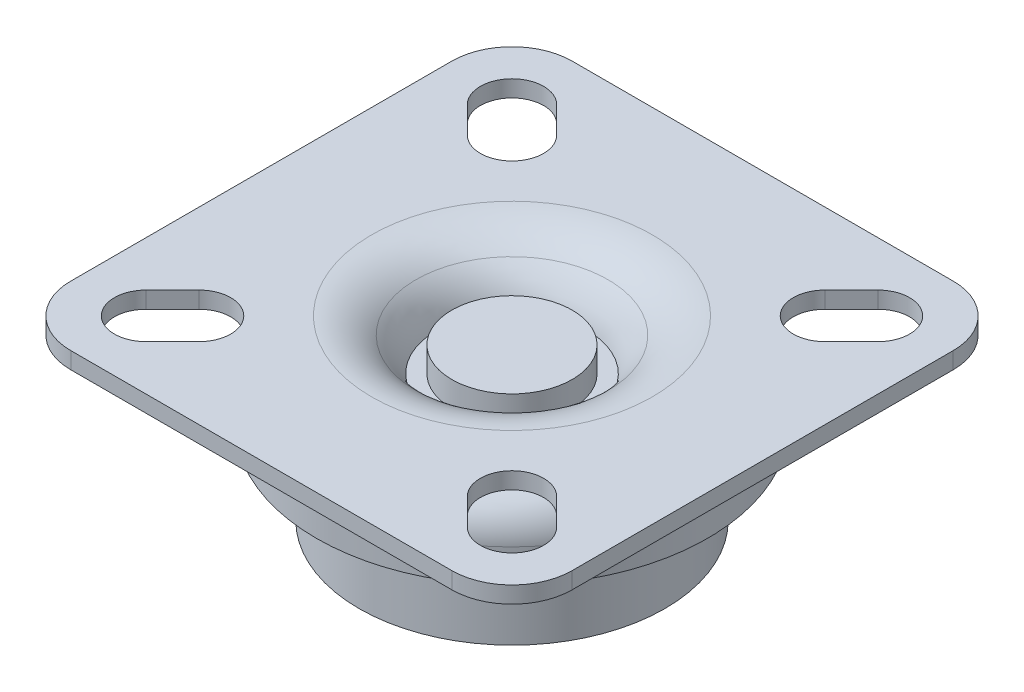
ISO-10303-21;
HEADER;
FILE_DESCRIPTION(('STEP AP214'),'2;1');
FILE_NAME('part.step','',(''),(''),'','','');
FILE_SCHEMA(('AUTOMOTIVE_DESIGN { 1 0 10303 214 1 1 1 1 }'));
ENDSEC;
DATA;
#1=APPLICATION_CONTEXT('core data for automotive mechanical design processes');
#2=APPLICATION_PROTOCOL_DEFINITION('international standard','automotive_design',2000,#1);
#3=PRODUCT_CONTEXT('',#1,'mechanical');
#4=PRODUCT('Part','Part','',(#3));
#5=PRODUCT_RELATED_PRODUCT_CATEGORY('part','',(#4));
#6=PRODUCT_DEFINITION_FORMATION('','',#4);
#7=PRODUCT_DEFINITION_CONTEXT('part definition',#1,'design');
#8=PRODUCT_DEFINITION('design','',#6,#7);
#9=PRODUCT_DEFINITION_SHAPE('','',#8);
#10=(LENGTH_UNIT() NAMED_UNIT(*) SI_UNIT(.MILLI.,.METRE.));
#11=(NAMED_UNIT(*) PLANE_ANGLE_UNIT() SI_UNIT($,.RADIAN.));
#12=(NAMED_UNIT(*) SI_UNIT($,.STERADIAN.) SOLID_ANGLE_UNIT());
#13=UNCERTAINTY_MEASURE_WITH_UNIT(LENGTH_MEASURE(1.E-05),#10,'distance_accuracy_value','');
#14=(GEOMETRIC_REPRESENTATION_CONTEXT(3) GLOBAL_UNCERTAINTY_ASSIGNED_CONTEXT((#13)) GLOBAL_UNIT_ASSIGNED_CONTEXT((#10,
#11,#12)) REPRESENTATION_CONTEXT('',''));
#15=CARTESIAN_POINT('',(0.,0.,0.));
#16=DIRECTION('',(0.,0.,1.));
#17=DIRECTION('',(1.,0.,0.));
#18=AXIS2_PLACEMENT_3D('',#15,#16,#17);
#19=CARTESIAN_POINT('',(15.25,-7.8,0.));
#20=DIRECTION('',(0.,1.,0.));
#21=DIRECTION('',(0.,0.,1.));
#22=AXIS2_PLACEMENT_3D('',#19,#20,#21);
#23=PLANE('',#22);
#24=CARTESIAN_POINT('',(0.,-7.8,0.));
#25=DIRECTION('',(0.,1.,0.));
#26=DIRECTION('',(0.,0.,1.));
#27=AXIS2_PLACEMENT_3D('',#24,#25,#26);
#28=CIRCLE('',#27,19.51);
#29=CARTESIAN_POINT('',(0.,-7.8,19.51));
#30=VERTEX_POINT('',#29);
#31=EDGE_CURVE('E67',#30,#30,#28,.T.);
#32=ORIENTED_EDGE('',*,*,#31,.F.);
#33=EDGE_LOOP('',(#32));
#34=FACE_BOUND('',#33,.T.);
#35=CARTESIAN_POINT('',(0.,-7.8,0.));
#36=DIRECTION('',(0.,1.,0.));
#37=DIRECTION('',(0.,0.,1.));
#38=AXIS2_PLACEMENT_3D('',#35,#36,#37);
#39=CIRCLE('',#38,15.25);
#40=CARTESIAN_POINT('',(0.,-7.8,15.25));
#41=VERTEX_POINT('',#40);
#42=EDGE_CURVE('E58',#41,#41,#39,.T.);
#43=ORIENTED_EDGE('',*,*,#42,.T.);
#44=EDGE_LOOP('',(#43));
#45=FACE_BOUND('',#44,.T.);
#46=ADVANCED_FACE('F47',(#34,#45),#23,.F.);
#47=CARTESIAN_POINT('',(0.,0.,0.));
#48=DIRECTION('',(0.,1.,0.));
#49=DIRECTION('',(0.,0.,1.));
#50=AXIS2_PLACEMENT_3D('',#47,#48,#49);
#51=CYLINDRICAL_SURFACE('',#50,15.25);
#52=ORIENTED_EDGE('',*,*,#42,.F.);
#53=EDGE_LOOP('',(#52));
#54=FACE_BOUND('',#53,.T.);
#55=CARTESIAN_POINT('',(0.,-16.,0.));
#56=DIRECTION('',(0.,1.,0.));
#57=DIRECTION('',(0.,0.,1.));
#58=AXIS2_PLACEMENT_3D('',#55,#56,#57);
#59=CIRCLE('',#58,15.25);
#60=CARTESIAN_POINT('',(0.,-16.,15.25));
#61=VERTEX_POINT('',#60);
#62=EDGE_CURVE('E62',#61,#61,#59,.T.);
#63=ORIENTED_EDGE('',*,*,#62,.T.);
#64=EDGE_LOOP('',(#63));
#65=FACE_BOUND('',#64,.T.);
#66=ADVANCED_FACE('F113',(#54,#65),#51,.T.);
#67=CARTESIAN_POINT('',(15.25,-16.,0.));
#68=DIRECTION('',(0.,1.,0.));
#69=DIRECTION('',(0.,0.,1.));
#70=AXIS2_PLACEMENT_3D('',#67,#68,#69);
#71=PLANE('',#70);
#72=ORIENTED_EDGE('',*,*,#62,.F.);
#73=EDGE_LOOP('',(#72));
#74=FACE_BOUND('',#73,.T.);
#75=CARTESIAN_POINT('',(0.,-16.,0.));
#76=DIRECTION('',(0.,1.,0.));
#77=DIRECTION('',(0.,0.,1.));
#78=AXIS2_PLACEMENT_3D('',#75,#76,#77);
#79=CIRCLE('',#78,13.85);
#80=CARTESIAN_POINT('',(0.,-16.,13.85));
#81=VERTEX_POINT('',#80);
#82=EDGE_CURVE('E72',#81,#81,#79,.T.);
#83=ORIENTED_EDGE('',*,*,#82,.T.);
#84=EDGE_LOOP('',(#83));
#85=FACE_BOUND('',#84,.T.);
#86=ADVANCED_FACE('F118',(#74,#85),#71,.F.);
#87=CARTESIAN_POINT('',(0.,-21.5974056603774,0.));
#88=DIRECTION('',(0.,1.,0.));
#89=DIRECTION('',(0.,0.,1.));
#90=AXIS2_PLACEMENT_3D('',#87,#88,#89);
#91=DEGENERATE_TOROIDAL_SURFACE('',#90,4.5,10.8974056603774,.T.);
#92=ORIENTED_EDGE('',*,*,#82,.F.);
#93=EDGE_LOOP('',(#92));
#94=FACE_BOUND('',#93,.T.);
#95=CARTESIAN_POINT('',(0.,-10.7,0.));
#96=DIRECTION('',(0.,1.,0.));
#97=DIRECTION('',(0.,0.,1.));
#98=AXIS2_PLACEMENT_3D('',#95,#96,#97);
#99=CIRCLE('',#98,4.5);
#100=CARTESIAN_POINT('',(0.,-10.7,4.5));
#101=VERTEX_POINT('',#100);
#102=EDGE_CURVE('E75',#101,#101,#99,.T.);
#103=ORIENTED_EDGE('',*,*,#102,.T.);
#104=EDGE_LOOP('',(#103));
#105=FACE_BOUND('',#104,.T.);
#106=ADVANCED_FACE('F109',(#94,#105),#91,.F.);
#107=CARTESIAN_POINT('',(0.,-10.7,0.));
#108=DIRECTION('',(0.,1.,0.));
#109=DIRECTION('',(0.,0.,1.));
#110=AXIS2_PLACEMENT_3D('',#107,#108,#109);
#111=PLANE('',#110);
#112=ORIENTED_EDGE('',*,*,#102,.F.);
#113=EDGE_LOOP('',(#112));
#114=FACE_BOUND('',#113,.T.);
#115=ADVANCED_FACE('F101',(#114),#111,.F.);
#116=CARTESIAN_POINT('',(0.,0.,0.));
#117=DIRECTION('',(0.,-1.,0.));
#118=DIRECTION('',(0.,0.,-1.));
#119=AXIS2_PLACEMENT_3D('',#116,#117,#118);
#120=PLANE('',#119);
#121=CARTESIAN_POINT('',(0.,0.,0.));
#122=DIRECTION('',(0.,-1.,0.));
#123=DIRECTION('',(0.,0.,-1.));
#124=AXIS2_PLACEMENT_3D('',#121,#122,#123);
#125=CIRCLE('',#124,15.01);
#126=CARTESIAN_POINT('',(0.,0.,-15.01));
#127=VERTEX_POINT('',#126);
#128=EDGE_CURVE('E54',#127,#127,#125,.F.);
#129=ORIENTED_EDGE('',*,*,#128,.T.);
#130=EDGE_LOOP('',(#129));
#131=FACE_BOUND('',#130,.T.);
#132=CARTESIAN_POINT('',(0.,0.,0.));
#133=DIRECTION('',(0.,1.,0.));
#134=DIRECTION('',(0.,0.,1.));
#135=AXIS2_PLACEMENT_3D('',#132,#133,#134);
#136=CIRCLE('',#135,9.5760424956833);
#137=CARTESIAN_POINT('',(0.,0.,9.5760424956833));
#138=VERTEX_POINT('',#137);
#139=EDGE_CURVE('E65',#138,#138,#136,.F.);
#140=ORIENTED_EDGE('',*,*,#139,.T.);
#141=EDGE_LOOP('',(#140));
#142=FACE_BOUND('',#141,.T.);
#143=ADVANCED_FACE('F99',(#131,#142),#120,.F.);
#144=CARTESIAN_POINT('',(0.,0.,0.));
#145=DIRECTION('',(0.,1.,0.));
#146=DIRECTION('',(0.,0.,1.));
#147=AXIS2_PLACEMENT_3D('',#144,#145,#146);
#148=CYLINDRICAL_SURFACE('',#147,19.51);
#149=CARTESIAN_POINT('',(0.,-4.5,0.));
#150=DIRECTION('',(0.,-1.,0.));
#151=DIRECTION('',(0.,0.,-1.));
#152=AXIS2_PLACEMENT_3D('',#149,#150,#151);
#153=CIRCLE('',#152,19.51);
#154=CARTESIAN_POINT('',(0.,-4.5,-19.51));
#155=VERTEX_POINT('',#154);
#156=EDGE_CURVE('E11',#155,#155,#153,.T.);
#157=ORIENTED_EDGE('',*,*,#156,.T.);
#158=EDGE_LOOP('',(#157));
#159=FACE_BOUND('',#158,.T.);
#160=ORIENTED_EDGE('',*,*,#31,.T.);
#161=EDGE_LOOP('',(#160));
#162=FACE_BOUND('',#161,.T.);
#163=ADVANCED_FACE('F95',(#159,#162),#148,.T.);
#164=CARTESIAN_POINT('',(0.,-5.065,0.));
#165=DIRECTION('',(0.,1.,0.));
#166=DIRECTION('',(0.,0.,1.));
#167=AXIS2_PLACEMENT_3D('',#164,#165,#166);
#168=TOROIDAL_SURFACE('',#167,14.,6.725);
#169=CARTESIAN_POINT('',(0.,-3.34,0.));
#170=DIRECTION('',(0.,1.,0.));
#171=DIRECTION('',(0.,0.,1.));
#172=AXIS2_PLACEMENT_3D('',#169,#170,#171);
#173=CIRCLE('',#172,7.5);
#174=CARTESIAN_POINT('',(0.,-3.34,7.5));
#175=VERTEX_POINT('',#174);
#176=EDGE_CURVE('E85',#175,#175,#173,.T.);
#177=ORIENTED_EDGE('',*,*,#176,.F.);
#178=EDGE_LOOP('',(#177));
#179=FACE_BOUND('',#178,.T.);
#180=ORIENTED_EDGE('',*,*,#139,.F.);
#181=EDGE_LOOP('',(#180));
#182=FACE_BOUND('',#181,.T.);
#183=ADVANCED_FACE('F91',(#179,#182),#168,.T.);
#184=CARTESIAN_POINT('',(-6.,-0.839999999999999,0.));
#185=DIRECTION('',(0.,-1.,0.));
#186=DIRECTION('',(0.,0.,-1.));
#187=AXIS2_PLACEMENT_3D('',#184,#185,#186);
#188=PLANE('',#187);
#189=CARTESIAN_POINT('',(0.,-0.839999999999999,0.));
#190=DIRECTION('',(0.,1.,0.));
#191=DIRECTION('',(0.,0.,1.));
#192=AXIS2_PLACEMENT_3D('',#189,#190,#191);
#193=CIRCLE('',#192,6.);
#194=CARTESIAN_POINT('',(0.,-0.839999999999999,6.));
#195=VERTEX_POINT('',#194);
#196=EDGE_CURVE('E68',#195,#195,#193,.T.);
#197=ORIENTED_EDGE('',*,*,#196,.T.);
#198=EDGE_LOOP('',(#197));
#199=FACE_BOUND('',#198,.T.);
#200=ADVANCED_FACE('F94',(#199),#188,.F.);
#201=CARTESIAN_POINT('',(0.,1.66,0.));
#202=DIRECTION('',(0.,1.,0.));
#203=DIRECTION('',(0.,0.,1.));
#204=AXIS2_PLACEMENT_3D('',#201,#202,#203);
#205=CYLINDRICAL_SURFACE('',#204,6.);
#206=ORIENTED_EDGE('',*,*,#196,.F.);
#207=EDGE_LOOP('',(#206));
#208=FACE_BOUND('',#207,.T.);
#209=CARTESIAN_POINT('',(0.,-3.34,0.));
#210=DIRECTION('',(0.,1.,0.));
#211=DIRECTION('',(0.,0.,1.));
#212=AXIS2_PLACEMENT_3D('',#209,#210,#211);
#213=CIRCLE('',#212,6.);
#214=CARTESIAN_POINT('',(0.,-3.34,6.));
#215=VERTEX_POINT('',#214);
#216=EDGE_CURVE('E82',#215,#215,#213,.T.);
#217=ORIENTED_EDGE('',*,*,#216,.T.);
#218=EDGE_LOOP('',(#217));
#219=FACE_BOUND('',#218,.T.);
#220=ADVANCED_FACE('F152',(#208,#219),#205,.T.);
#221=CARTESIAN_POINT('',(-6.,-3.34,0.));
#222=DIRECTION('',(0.,-1.,0.));
#223=DIRECTION('',(0.,0.,-1.));
#224=AXIS2_PLACEMENT_3D('',#221,#222,#223);
#225=PLANE('',#224);
#226=ORIENTED_EDGE('',*,*,#216,.F.);
#227=EDGE_LOOP('',(#226));
#228=FACE_BOUND('',#227,.T.);
#229=ORIENTED_EDGE('',*,*,#176,.T.);
#230=EDGE_LOOP('',(#229));
#231=FACE_BOUND('',#230,.T.);
#232=ADVANCED_FACE('F89',(#228,#231),#225,.F.);
#233=CARTESIAN_POINT('',(0.,-4.5,0.));
#234=DIRECTION('',(0.,-1.,0.));
#235=DIRECTION('',(0.,0.,-1.));
#236=AXIS2_PLACEMENT_3D('',#233,#234,#235);
#237=TOROIDAL_SURFACE('',#236,15.01,4.5);
#238=ORIENTED_EDGE('',*,*,#156,.F.);
#239=EDGE_LOOP('',(#238));
#240=FACE_BOUND('',#239,.T.);
#241=ORIENTED_EDGE('',*,*,#128,.F.);
#242=EDGE_LOOP('',(#241));
#243=FACE_BOUND('',#242,.T.);
#244=ADVANCED_FACE('F49',(#240,#243),#237,.T.);
#245=CLOSED_SHELL('',(#46,#66,#86,#106,#115,#143,#163,#183,#200,#220,#232,#244));
#246=MANIFOLD_SOLID_BREP('B2',#245);
#247=CARTESIAN_POINT('',(25.,1.66,25.));
#248=DIRECTION('',(-1.,0.,0.));
#249=DIRECTION('',(0.,0.,1.));
#250=AXIS2_PLACEMENT_3D('',#247,#248,#249);
#251=PLANE('',#250);
#252=DIRECTION('',(0.,0.,-1.));
#253=VECTOR('',#252,1.);
#254=CARTESIAN_POINT('',(25.,1.66,25.));
#255=LINE('',#254,#253);
#256=CARTESIAN_POINT('',(25.,1.66,19.));
#257=VERTEX_POINT('',#256);
#258=CARTESIAN_POINT('',(25.,1.66,-19.));
#259=VERTEX_POINT('',#258);
#260=EDGE_CURVE('E496',#257,#259,#255,.T.);
#261=ORIENTED_EDGE('',*,*,#260,.F.);
#262=DIRECTION('',(0.,-1.,0.));
#263=VECTOR('',#262,1.);
#264=CARTESIAN_POINT('',(25.,1.66,19.));
#265=LINE('',#264,#263);
#266=CARTESIAN_POINT('',(25.,0.,19.));
#267=VERTEX_POINT('',#266);
#268=EDGE_CURVE('E521',#257,#267,#265,.T.);
#269=ORIENTED_EDGE('',*,*,#268,.T.);
#270=DIRECTION('',(0.,0.,-1.));
#271=VECTOR('',#270,1.);
#272=CARTESIAN_POINT('',(25.,0.,25.));
#273=LINE('',#272,#271);
#274=CARTESIAN_POINT('',(25.,0.,-19.));
#275=VERTEX_POINT('',#274);
#276=EDGE_CURVE('E489',#267,#275,#273,.T.);
#277=ORIENTED_EDGE('',*,*,#276,.T.);
#278=DIRECTION('',(0.,-1.,0.));
#279=VECTOR('',#278,1.);
#280=CARTESIAN_POINT('',(25.,1.66,-19.));
#281=LINE('',#280,#279);
#282=EDGE_CURVE('E509',#275,#259,#281,.F.);
#283=ORIENTED_EDGE('',*,*,#282,.T.);
#284=EDGE_LOOP('',(#261,#269,#277,#283));
#285=FACE_BOUND('',#284,.T.);
#286=ADVANCED_FACE('F199',(#285),#251,.F.);
#287=CARTESIAN_POINT('',(-25.,1.66,-25.));
#288=DIRECTION('',(0.,0.,1.));
#289=DIRECTION('',(1.,0.,0.));
#290=AXIS2_PLACEMENT_3D('',#287,#288,#289);
#291=PLANE('',#290);
#292=DIRECTION('',(-1.,0.,0.));
#293=VECTOR('',#292,1.);
#294=CARTESIAN_POINT('',(-25.,0.,-25.));
#295=LINE('',#294,#293);
#296=CARTESIAN_POINT('',(19.,0.,-25.));
#297=VERTEX_POINT('',#296);
#298=CARTESIAN_POINT('',(-19.,0.,-25.));
#299=VERTEX_POINT('',#298);
#300=EDGE_CURVE('E512',#297,#299,#295,.T.);
#301=ORIENTED_EDGE('',*,*,#300,.T.);
#302=DIRECTION('',(0.,-1.,0.));
#303=VECTOR('',#302,1.);
#304=CARTESIAN_POINT('',(-19.,1.66,-25.));
#305=LINE('',#304,#303);
#306=CARTESIAN_POINT('',(-19.,1.66,-25.));
#307=VERTEX_POINT('',#306);
#308=EDGE_CURVE('E45',#299,#307,#305,.F.);
#309=ORIENTED_EDGE('',*,*,#308,.T.);
#310=DIRECTION('',(-1.,0.,0.));
#311=VECTOR('',#310,1.);
#312=CARTESIAN_POINT('',(-25.,1.66,-25.));
#313=LINE('',#312,#311);
#314=CARTESIAN_POINT('',(19.,1.66,-25.));
#315=VERTEX_POINT('',#314);
#316=EDGE_CURVE('E499',#315,#307,#313,.T.);
#317=ORIENTED_EDGE('',*,*,#316,.F.);
#318=DIRECTION('',(0.,-1.,0.));
#319=VECTOR('',#318,1.);
#320=CARTESIAN_POINT('',(19.,1.66,-25.));
#321=LINE('',#320,#319);
#322=EDGE_CURVE('E208',#315,#297,#321,.T.);
#323=ORIENTED_EDGE('',*,*,#322,.T.);
#324=EDGE_LOOP('',(#301,#309,#317,#323));
#325=FACE_BOUND('',#324,.T.);
#326=ADVANCED_FACE('F555',(#325),#291,.F.);
#327=CARTESIAN_POINT('',(-25.,1.66,25.));
#328=DIRECTION('',(1.,0.,0.));
#329=DIRECTION('',(0.,0.,-1.));
#330=AXIS2_PLACEMENT_3D('',#327,#328,#329);
#331=PLANE('',#330);
#332=DIRECTION('',(0.,0.,1.));
#333=VECTOR('',#332,1.);
#334=CARTESIAN_POINT('',(-25.,1.66,25.));
#335=LINE('',#334,#333);
#336=CARTESIAN_POINT('',(-25.,1.66,-19.));
#337=VERTEX_POINT('',#336);
#338=CARTESIAN_POINT('',(-25.,1.66,19.));
#339=VERTEX_POINT('',#338);
#340=EDGE_CURVE('E503',#337,#339,#335,.T.);
#341=ORIENTED_EDGE('',*,*,#340,.F.);
#342=DIRECTION('',(0.,-1.,0.));
#343=VECTOR('',#342,1.);
#344=CARTESIAN_POINT('',(-25.,1.66,-19.));
#345=LINE('',#344,#343);
#346=CARTESIAN_POINT('',(-25.,0.,-19.));
#347=VERTEX_POINT('',#346);
#348=EDGE_CURVE('E547',#337,#347,#345,.T.);
#349=ORIENTED_EDGE('',*,*,#348,.T.);
#350=DIRECTION('',(0.,0.,1.));
#351=VECTOR('',#350,1.);
#352=CARTESIAN_POINT('',(-25.,0.,25.));
#353=LINE('',#352,#351);
#354=CARTESIAN_POINT('',(-25.,0.,19.));
#355=VERTEX_POINT('',#354);
#356=EDGE_CURVE('E515',#347,#355,#353,.T.);
#357=ORIENTED_EDGE('',*,*,#356,.T.);
#358=DIRECTION('',(0.,-1.,0.));
#359=VECTOR('',#358,1.);
#360=CARTESIAN_POINT('',(-25.,1.66,19.));
#361=LINE('',#360,#359);
#362=EDGE_CURVE('E545',#355,#339,#361,.F.);
#363=ORIENTED_EDGE('',*,*,#362,.T.);
#364=EDGE_LOOP('',(#341,#349,#357,#363));
#365=FACE_BOUND('',#364,.T.);
#366=ADVANCED_FACE('F568',(#365),#331,.F.);
#367=CARTESIAN_POINT('',(-25.,1.66,25.));
#368=DIRECTION('',(0.,0.,-1.));
#369=DIRECTION('',(-1.,0.,0.));
#370=AXIS2_PLACEMENT_3D('',#367,#368,#369);
#371=PLANE('',#370);
#372=DIRECTION('',(1.,0.,0.));
#373=VECTOR('',#372,1.);
#374=CARTESIAN_POINT('',(-25.,0.,25.));
#375=LINE('',#374,#373);
#376=CARTESIAN_POINT('',(-19.,0.,25.));
#377=VERTEX_POINT('',#376);
#378=CARTESIAN_POINT('',(19.,0.,25.));
#379=VERTEX_POINT('',#378);
#380=EDGE_CURVE('E500',#377,#379,#375,.T.);
#381=ORIENTED_EDGE('',*,*,#380,.T.);
#382=DIRECTION('',(0.,-1.,0.));
#383=VECTOR('',#382,1.);
#384=CARTESIAN_POINT('',(19.,1.66,25.));
#385=LINE('',#384,#383);
#386=CARTESIAN_POINT('',(19.,1.66,25.));
#387=VERTEX_POINT('',#386);
#388=EDGE_CURVE('E535',#379,#387,#385,.F.);
#389=ORIENTED_EDGE('',*,*,#388,.T.);
#390=DIRECTION('',(1.,0.,0.));
#391=VECTOR('',#390,1.);
#392=CARTESIAN_POINT('',(-25.,1.66,25.));
#393=LINE('',#392,#391);
#394=CARTESIAN_POINT('',(-19.,1.66,25.));
#395=VERTEX_POINT('',#394);
#396=EDGE_CURVE('E506',#395,#387,#393,.T.);
#397=ORIENTED_EDGE('',*,*,#396,.F.);
#398=DIRECTION('',(0.,-1.,0.));
#399=VECTOR('',#398,1.);
#400=CARTESIAN_POINT('',(-19.,1.66,25.));
#401=LINE('',#400,#399);
#402=EDGE_CURVE('E532',#395,#377,#401,.T.);
#403=ORIENTED_EDGE('',*,*,#402,.T.);
#404=EDGE_LOOP('',(#381,#389,#397,#403));
#405=FACE_BOUND('',#404,.T.);
#406=ADVANCED_FACE('F578',(#405),#371,.F.);
#407=CARTESIAN_POINT('',(0.,1.66,0.));
#408=DIRECTION('',(0.,-1.,0.));
#409=DIRECTION('',(0.,0.,-1.));
#410=AXIS2_PLACEMENT_3D('',#407,#408,#409);
#411=PLANE('',#410);
#412=CARTESIAN_POINT('',(0.,1.66,0.));
#413=DIRECTION('',(0.,1.,0.));
#414=DIRECTION('',(0.,0.,1.));
#415=AXIS2_PLACEMENT_3D('',#412,#413,#414);
#416=CIRCLE('',#415,14.);
#417=CARTESIAN_POINT('',(0.,1.66,14.));
#418=VERTEX_POINT('',#417);
#419=EDGE_CURVE('E387',#418,#418,#416,.T.);
#420=ORIENTED_EDGE('',*,*,#419,.F.);
#421=EDGE_LOOP('',(#420));
#422=FACE_BOUND('',#421,.T.);
#423=DIRECTION('',(-0.707106781186549,0.,-0.707106781186546));
#424=VECTOR('',#423,1.);
#425=CARTESIAN_POINT('',(-13.3726136392624,1.66,-17.8273863607376));
#426=LINE('',#425,#424);
#427=CARTESIAN_POINT('',(-13.3726136392624,1.66,-17.8273863607376));
#428=VERTEX_POINT('',#427);
#429=CARTESIAN_POINT('',(-16.0226136392624,1.66,-20.4773863607376));
#430=VERTEX_POINT('',#429);
#431=EDGE_CURVE('E392',#428,#430,#426,.T.);
#432=ORIENTED_EDGE('',*,*,#431,.F.);
#433=CARTESIAN_POINT('',(-15.6000000000001,1.66,-15.5999999999999));
#434=DIRECTION('',(0.,1.,0.));
#435=DIRECTION('',(1.,0.,0.));
#436=AXIS2_PLACEMENT_3D('',#433,#434,#435);
#437=CIRCLE('',#436,3.15);
#438=CARTESIAN_POINT('',(-17.8273863607377,1.66,-13.3726136392623));
#439=VERTEX_POINT('',#438);
#440=EDGE_CURVE('E215',#439,#428,#437,.T.);
#441=ORIENTED_EDGE('',*,*,#440,.F.);
#442=DIRECTION('',(0.707106781186548,0.,0.707106781186547));
#443=VECTOR('',#442,1.);
#444=CARTESIAN_POINT('',(-17.8273863607377,1.66,-13.3726136392623));
#445=LINE('',#444,#443);
#446=CARTESIAN_POINT('',(-20.4773863607377,1.66,-16.0226136392623));
#447=VERTEX_POINT('',#446);
#448=EDGE_CURVE('E381',#447,#439,#445,.T.);
#449=ORIENTED_EDGE('',*,*,#448,.F.);
#450=CARTESIAN_POINT('',(-18.2500000000001,1.66,-18.2499999999999));
#451=DIRECTION('',(0.,1.,0.));
#452=DIRECTION('',(1.,0.,0.));
#453=AXIS2_PLACEMENT_3D('',#450,#451,#452);
#454=CIRCLE('',#453,3.15);
#455=EDGE_CURVE('E384',#430,#447,#454,.T.);
#456=ORIENTED_EDGE('',*,*,#455,.F.);
#457=EDGE_LOOP('',(#432,#441,#449,#456));
#458=FACE_BOUND('',#457,.T.);
#459=DIRECTION('',(-0.707106781186548,0.,0.707106781186547));
#460=VECTOR('',#459,1.);
#461=CARTESIAN_POINT('',(-17.8273863607376,1.66,13.3726136392624));
#462=LINE('',#461,#460);
#463=CARTESIAN_POINT('',(-17.8273863607376,1.66,13.3726136392624));
#464=VERTEX_POINT('',#463);
#465=CARTESIAN_POINT('',(-20.4773863607376,1.66,16.0226136392624));
#466=VERTEX_POINT('',#465);
#467=EDGE_CURVE('E418',#464,#466,#462,.T.);
#468=ORIENTED_EDGE('',*,*,#467,.F.);
#469=CARTESIAN_POINT('',(-15.6,1.66,15.6));
#470=DIRECTION('',(0.,1.,0.));
#471=DIRECTION('',(0.,0.,-1.));
#472=AXIS2_PLACEMENT_3D('',#469,#470,#471);
#473=CIRCLE('',#472,3.15);
#474=CARTESIAN_POINT('',(-13.3726136392624,1.66,17.8273863607376));
#475=VERTEX_POINT('',#474);
#476=EDGE_CURVE('E223',#475,#464,#473,.T.);
#477=ORIENTED_EDGE('',*,*,#476,.F.);
#478=DIRECTION('',(0.707106781186549,0.,-0.707106781186546));
#479=VECTOR('',#478,1.);
#480=CARTESIAN_POINT('',(-13.3726136392624,1.66,17.8273863607376));
#481=LINE('',#480,#479);
#482=CARTESIAN_POINT('',(-16.0226136392624,1.66,20.4773863607376));
#483=VERTEX_POINT('',#482);
#484=EDGE_CURVE('E407',#483,#475,#481,.T.);
#485=ORIENTED_EDGE('',*,*,#484,.F.);
#486=CARTESIAN_POINT('',(-18.25,1.66,18.25));
#487=DIRECTION('',(0.,1.,0.));
#488=DIRECTION('',(0.,0.,-1.));
#489=AXIS2_PLACEMENT_3D('',#486,#487,#488);
#490=CIRCLE('',#489,3.15);
#491=EDGE_CURVE('E422',#466,#483,#490,.T.);
#492=ORIENTED_EDGE('',*,*,#491,.F.);
#493=EDGE_LOOP('',(#468,#477,#485,#492));
#494=FACE_BOUND('',#493,.T.);
#495=DIRECTION('',(0.707106781186554,0.,0.707106781186541));
#496=VECTOR('',#495,1.);
#497=CARTESIAN_POINT('',(13.3726136392626,1.66,17.8273863607375));
#498=LINE('',#497,#496);
#499=CARTESIAN_POINT('',(13.3726136392626,1.66,17.8273863607375));
#500=VERTEX_POINT('',#499);
#501=CARTESIAN_POINT('',(16.0226136392626,1.66,20.4773863607375));
#502=VERTEX_POINT('',#501);
#503=EDGE_CURVE('E449',#500,#502,#498,.T.);
#504=ORIENTED_EDGE('',*,*,#503,.F.);
#505=CARTESIAN_POINT('',(15.6000000000002,1.66,15.5999999999998));
#506=DIRECTION('',(0.,1.,0.));
#507=DIRECTION('',(-1.,0.,0.));
#508=AXIS2_PLACEMENT_3D('',#505,#506,#507);
#509=CIRCLE('',#508,3.15);
#510=CARTESIAN_POINT('',(17.8273863607378,1.66,13.3726136392622));
#511=VERTEX_POINT('',#510);
#512=EDGE_CURVE('E447',#511,#500,#509,.T.);
#513=ORIENTED_EDGE('',*,*,#512,.F.);
#514=DIRECTION('',(-0.707106781186553,0.,-0.707106781186542));
#515=VECTOR('',#514,1.);
#516=CARTESIAN_POINT('',(17.8273863607378,1.66,13.3726136392622));
#517=LINE('',#516,#515);
#518=CARTESIAN_POINT('',(20.4773863607378,1.66,16.0226136392622));
#519=VERTEX_POINT('',#518);
#520=EDGE_CURVE('E437',#519,#511,#517,.T.);
#521=ORIENTED_EDGE('',*,*,#520,.F.);
#522=CARTESIAN_POINT('',(18.2500000000002,1.66,18.2499999999998));
#523=DIRECTION('',(0.,1.,0.));
#524=DIRECTION('',(-1.,0.,0.));
#525=AXIS2_PLACEMENT_3D('',#522,#523,#524);
#526=CIRCLE('',#525,3.15);
#527=EDGE_CURVE('E452',#502,#519,#526,.T.);
#528=ORIENTED_EDGE('',*,*,#527,.F.);
#529=EDGE_LOOP('',(#504,#513,#521,#528));
#530=FACE_BOUND('',#529,.T.);
#531=DIRECTION('',(0.707106781186548,0.,-0.707106781186547));
#532=VECTOR('',#531,1.);
#533=CARTESIAN_POINT('',(17.8273863607376,1.66,-13.3726136392624));
#534=LINE('',#533,#532);
#535=CARTESIAN_POINT('',(17.8273863607376,1.66,-13.3726136392624));
#536=VERTEX_POINT('',#535);
#537=CARTESIAN_POINT('',(20.4773863607376,1.66,-16.0226136392624));
#538=VERTEX_POINT('',#537);
#539=EDGE_CURVE('E479',#536,#538,#534,.T.);
#540=ORIENTED_EDGE('',*,*,#539,.F.);
#541=CARTESIAN_POINT('',(15.6,1.66,-15.6));
#542=DIRECTION('',(0.,1.,0.));
#543=DIRECTION('',(0.,0.,1.));
#544=AXIS2_PLACEMENT_3D('',#541,#542,#543);
#545=CIRCLE('',#544,3.15);
#546=CARTESIAN_POINT('',(13.3726136392624,1.66,-17.8273863607376));
#547=VERTEX_POINT('',#546);
#548=EDGE_CURVE('E399',#547,#536,#545,.T.);
#549=ORIENTED_EDGE('',*,*,#548,.F.);
#550=DIRECTION('',(-0.707106781186549,0.,0.707106781186546));
#551=VECTOR('',#550,1.);
#552=CARTESIAN_POINT('',(13.3726136392624,1.66,-17.8273863607376));
#553=LINE('',#552,#551);
#554=CARTESIAN_POINT('',(16.0226136392624,1.66,-20.4773863607376));
#555=VERTEX_POINT('',#554);
#556=EDGE_CURVE('E468',#555,#547,#553,.T.);
#557=ORIENTED_EDGE('',*,*,#556,.F.);
#558=CARTESIAN_POINT('',(18.25,1.66,-18.25));
#559=DIRECTION('',(0.,1.,0.));
#560=DIRECTION('',(0.,0.,1.));
#561=AXIS2_PLACEMENT_3D('',#558,#559,#560);
#562=CIRCLE('',#561,3.15);
#563=EDGE_CURVE('E482',#538,#555,#562,.T.);
#564=ORIENTED_EDGE('',*,*,#563,.F.);
#565=EDGE_LOOP('',(#540,#549,#557,#564));
#566=FACE_BOUND('',#565,.T.);
#567=ORIENTED_EDGE('',*,*,#396,.T.);
#568=CARTESIAN_POINT('',(19.,1.66,19.));
#569=DIRECTION('',(0.,-1.,0.));
#570=DIRECTION('',(0.,0.,-1.));
#571=AXIS2_PLACEMENT_3D('',#568,#569,#570);
#572=CIRCLE('',#571,6.);
#573=EDGE_CURVE('E543',#387,#257,#572,.F.);
#574=ORIENTED_EDGE('',*,*,#573,.T.);
#575=ORIENTED_EDGE('',*,*,#260,.T.);
#576=CARTESIAN_POINT('',(19.,1.66,-19.));
#577=DIRECTION('',(0.,-1.,0.));
#578=DIRECTION('',(0.,0.,-1.));
#579=AXIS2_PLACEMENT_3D('',#576,#577,#578);
#580=CIRCLE('',#579,6.);
#581=EDGE_CURVE('E539',#259,#315,#580,.F.);
#582=ORIENTED_EDGE('',*,*,#581,.T.);
#583=ORIENTED_EDGE('',*,*,#316,.T.);
#584=CARTESIAN_POINT('',(-19.,1.66,-19.));
#585=DIRECTION('',(0.,-1.,0.));
#586=DIRECTION('',(0.,0.,-1.));
#587=AXIS2_PLACEMENT_3D('',#584,#585,#586);
#588=CIRCLE('',#587,6.);
#589=EDGE_CURVE('E541',#307,#337,#588,.F.);
#590=ORIENTED_EDGE('',*,*,#589,.T.);
#591=ORIENTED_EDGE('',*,*,#340,.T.);
#592=CARTESIAN_POINT('',(-19.,1.66,19.));
#593=DIRECTION('',(0.,-1.,0.));
#594=DIRECTION('',(0.,0.,-1.));
#595=AXIS2_PLACEMENT_3D('',#592,#593,#594);
#596=CIRCLE('',#595,6.);
#597=EDGE_CURVE('E537',#339,#395,#596,.F.);
#598=ORIENTED_EDGE('',*,*,#597,.T.);
#599=EDGE_LOOP('',(#567,#574,#575,#582,#583,#590,#591,#598));
#600=FACE_BOUND('',#599,.T.);
#601=ADVANCED_FACE('F572',(#422,#458,#494,#530,#566,#600),#411,.F.);
#602=CARTESIAN_POINT('',(0.,0.,0.));
#603=DIRECTION('',(0.,-1.,0.));
#604=DIRECTION('',(0.,0.,-1.));
#605=AXIS2_PLACEMENT_3D('',#602,#603,#604);
#606=PLANE('',#605);
#607=CARTESIAN_POINT('',(0.,0.,0.));
#608=DIRECTION('',(0.,1.,0.));
#609=DIRECTION('',(0.,0.,1.));
#610=AXIS2_PLACEMENT_3D('',#607,#608,#609);
#611=CIRCLE('',#610,9.5760424956833);
#612=CARTESIAN_POINT('',(0.,0.,9.5760424956833));
#613=VERTEX_POINT('',#612);
#614=EDGE_CURVE('E203',#613,#613,#611,.F.);
#615=ORIENTED_EDGE('',*,*,#614,.F.);
#616=EDGE_LOOP('',(#615));
#617=FACE_BOUND('',#616,.T.);
#618=CARTESIAN_POINT('',(-15.6000000000001,0.,-15.5999999999999));
#619=DIRECTION('',(0.,1.,0.));
#620=DIRECTION('',(1.,0.,0.));
#621=AXIS2_PLACEMENT_3D('',#618,#619,#620);
#622=CIRCLE('',#621,3.15);
#623=CARTESIAN_POINT('',(-17.8273863607377,0.,-13.3726136392623));
#624=VERTEX_POINT('',#623);
#625=CARTESIAN_POINT('',(-13.3726136392624,0.,-17.8273863607376));
#626=VERTEX_POINT('',#625);
#627=EDGE_CURVE('E362',#624,#626,#622,.T.);
#628=ORIENTED_EDGE('',*,*,#627,.T.);
#629=DIRECTION('',(-0.707106781186549,0.,-0.707106781186546));
#630=VECTOR('',#629,1.);
#631=CARTESIAN_POINT('',(-13.3726136392624,0.,-17.8273863607376));
#632=LINE('',#631,#630);
#633=CARTESIAN_POINT('',(-16.0226136392624,0.,-20.4773863607376));
#634=VERTEX_POINT('',#633);
#635=EDGE_CURVE('E372',#626,#634,#632,.T.);
#636=ORIENTED_EDGE('',*,*,#635,.T.);
#637=CARTESIAN_POINT('',(-18.2500000000001,0.,-18.2499999999999));
#638=DIRECTION('',(0.,1.,0.));
#639=DIRECTION('',(1.,0.,0.));
#640=AXIS2_PLACEMENT_3D('',#637,#638,#639);
#641=CIRCLE('',#640,3.15);
#642=CARTESIAN_POINT('',(-20.4773863607377,0.,-16.0226136392623));
#643=VERTEX_POINT('',#642);
#644=EDGE_CURVE('E376',#634,#643,#641,.T.);
#645=ORIENTED_EDGE('',*,*,#644,.T.);
#646=DIRECTION('',(0.707106781186548,0.,0.707106781186547));
#647=VECTOR('',#646,1.);
#648=CARTESIAN_POINT('',(-17.8273863607377,0.,-13.3726136392623));
#649=LINE('',#648,#647);
#650=EDGE_CURVE('E368',#643,#624,#649,.T.);
#651=ORIENTED_EDGE('',*,*,#650,.T.);
#652=EDGE_LOOP('',(#628,#636,#645,#651));
#653=FACE_BOUND('',#652,.T.);
#654=CARTESIAN_POINT('',(-15.6,0.,15.6));
#655=DIRECTION('',(0.,1.,0.));
#656=DIRECTION('',(0.,0.,-1.));
#657=AXIS2_PLACEMENT_3D('',#654,#655,#656);
#658=CIRCLE('',#657,3.15);
#659=CARTESIAN_POINT('',(-13.3726136392624,0.,17.8273863607376));
#660=VERTEX_POINT('',#659);
#661=CARTESIAN_POINT('',(-17.8273863607376,0.,13.3726136392624));
#662=VERTEX_POINT('',#661);
#663=EDGE_CURVE('E403',#660,#662,#658,.T.);
#664=ORIENTED_EDGE('',*,*,#663,.T.);
#665=DIRECTION('',(-0.707106781186548,0.,0.707106781186547));
#666=VECTOR('',#665,1.);
#667=CARTESIAN_POINT('',(-17.8273863607376,0.,13.3726136392624));
#668=LINE('',#667,#666);
#669=CARTESIAN_POINT('',(-20.4773863607376,0.,16.0226136392624));
#670=VERTEX_POINT('',#669);
#671=EDGE_CURVE('E406',#662,#670,#668,.T.);
#672=ORIENTED_EDGE('',*,*,#671,.T.);
#673=CARTESIAN_POINT('',(-18.25,0.,18.25));
#674=DIRECTION('',(0.,1.,0.));
#675=DIRECTION('',(0.,0.,-1.));
#676=AXIS2_PLACEMENT_3D('',#673,#674,#675);
#677=CIRCLE('',#676,3.15);
#678=CARTESIAN_POINT('',(-16.0226136392624,0.,20.4773863607376));
#679=VERTEX_POINT('',#678);
#680=EDGE_CURVE('E410',#670,#679,#677,.T.);
#681=ORIENTED_EDGE('',*,*,#680,.T.);
#682=DIRECTION('',(0.707106781186549,0.,-0.707106781186546));
#683=VECTOR('',#682,1.);
#684=CARTESIAN_POINT('',(-13.3726136392624,0.,17.8273863607376));
#685=LINE('',#684,#683);
#686=EDGE_CURVE('E413',#679,#660,#685,.T.);
#687=ORIENTED_EDGE('',*,*,#686,.T.);
#688=EDGE_LOOP('',(#664,#672,#681,#687));
#689=FACE_BOUND('',#688,.T.);
#690=CARTESIAN_POINT('',(15.6000000000002,0.,15.5999999999998));
#691=DIRECTION('',(0.,1.,0.));
#692=DIRECTION('',(-1.,0.,0.));
#693=AXIS2_PLACEMENT_3D('',#690,#691,#692);
#694=CIRCLE('',#693,3.15);
#695=CARTESIAN_POINT('',(17.8273863607378,0.,13.3726136392622));
#696=VERTEX_POINT('',#695);
#697=CARTESIAN_POINT('',(13.3726136392626,0.,17.8273863607375));
#698=VERTEX_POINT('',#697);
#699=EDGE_CURVE('E433',#696,#698,#694,.T.);
#700=ORIENTED_EDGE('',*,*,#699,.T.);
#701=DIRECTION('',(0.707106781186554,0.,0.707106781186541));
#702=VECTOR('',#701,1.);
#703=CARTESIAN_POINT('',(13.3726136392626,0.,17.8273863607375));
#704=LINE('',#703,#702);
#705=CARTESIAN_POINT('',(16.0226136392626,0.,20.4773863607375));
#706=VERTEX_POINT('',#705);
#707=EDGE_CURVE('E436',#698,#706,#704,.T.);
#708=ORIENTED_EDGE('',*,*,#707,.T.);
#709=CARTESIAN_POINT('',(18.2500000000002,0.,18.2499999999998));
#710=DIRECTION('',(0.,1.,0.));
#711=DIRECTION('',(-1.,0.,0.));
#712=AXIS2_PLACEMENT_3D('',#709,#710,#711);
#713=CIRCLE('',#712,3.15);
#714=CARTESIAN_POINT('',(20.4773863607378,0.,16.0226136392622));
#715=VERTEX_POINT('',#714);
#716=EDGE_CURVE('E440',#706,#715,#713,.T.);
#717=ORIENTED_EDGE('',*,*,#716,.T.);
#718=DIRECTION('',(-0.707106781186553,0.,-0.707106781186542));
#719=VECTOR('',#718,1.);
#720=CARTESIAN_POINT('',(17.8273863607378,0.,13.3726136392622));
#721=LINE('',#720,#719);
#722=EDGE_CURVE('E443',#715,#696,#721,.T.);
#723=ORIENTED_EDGE('',*,*,#722,.T.);
#724=EDGE_LOOP('',(#700,#708,#717,#723));
#725=FACE_BOUND('',#724,.T.);
#726=CARTESIAN_POINT('',(15.6,0.,-15.6));
#727=DIRECTION('',(0.,1.,0.));
#728=DIRECTION('',(0.,0.,1.));
#729=AXIS2_PLACEMENT_3D('',#726,#727,#728);
#730=CIRCLE('',#729,3.15);
#731=CARTESIAN_POINT('',(13.3726136392624,0.,-17.8273863607376));
#732=VERTEX_POINT('',#731);
#733=CARTESIAN_POINT('',(17.8273863607376,0.,-13.3726136392624));
#734=VERTEX_POINT('',#733);
#735=EDGE_CURVE('E464',#732,#734,#730,.T.);
#736=ORIENTED_EDGE('',*,*,#735,.T.);
#737=DIRECTION('',(0.707106781186548,0.,-0.707106781186547));
#738=VECTOR('',#737,1.);
#739=CARTESIAN_POINT('',(17.8273863607376,0.,-13.3726136392624));
#740=LINE('',#739,#738);
#741=CARTESIAN_POINT('',(20.4773863607376,0.,-16.0226136392624));
#742=VERTEX_POINT('',#741);
#743=EDGE_CURVE('E467',#734,#742,#740,.T.);
#744=ORIENTED_EDGE('',*,*,#743,.T.);
#745=CARTESIAN_POINT('',(18.25,0.,-18.25));
#746=DIRECTION('',(0.,1.,0.));
#747=DIRECTION('',(0.,0.,1.));
#748=AXIS2_PLACEMENT_3D('',#745,#746,#747);
#749=CIRCLE('',#748,3.15);
#750=CARTESIAN_POINT('',(16.0226136392624,0.,-20.4773863607376));
#751=VERTEX_POINT('',#750);
#752=EDGE_CURVE('E471',#742,#751,#749,.T.);
#753=ORIENTED_EDGE('',*,*,#752,.T.);
#754=DIRECTION('',(-0.707106781186549,0.,0.707106781186546));
#755=VECTOR('',#754,1.);
#756=CARTESIAN_POINT('',(13.3726136392624,0.,-17.8273863607376));
#757=LINE('',#756,#755);
#758=EDGE_CURVE('E474',#751,#732,#757,.T.);
#759=ORIENTED_EDGE('',*,*,#758,.T.);
#760=EDGE_LOOP('',(#736,#744,#753,#759));
#761=FACE_BOUND('',#760,.T.);
#762=ORIENTED_EDGE('',*,*,#276,.F.);
#763=CARTESIAN_POINT('',(19.,0.,19.));
#764=DIRECTION('',(0.,-1.,0.));
#765=DIRECTION('',(0.,0.,-1.));
#766=AXIS2_PLACEMENT_3D('',#763,#764,#765);
#767=CIRCLE('',#766,6.);
#768=EDGE_CURVE('E530',#267,#379,#767,.T.);
#769=ORIENTED_EDGE('',*,*,#768,.T.);
#770=ORIENTED_EDGE('',*,*,#380,.F.);
#771=CARTESIAN_POINT('',(-19.,0.,19.));
#772=DIRECTION('',(0.,-1.,0.));
#773=DIRECTION('',(0.,0.,-1.));
#774=AXIS2_PLACEMENT_3D('',#771,#772,#773);
#775=CIRCLE('',#774,6.);
#776=EDGE_CURVE('E524',#377,#355,#775,.T.);
#777=ORIENTED_EDGE('',*,*,#776,.T.);
#778=ORIENTED_EDGE('',*,*,#356,.F.);
#779=CARTESIAN_POINT('',(-19.,0.,-19.));
#780=DIRECTION('',(0.,-1.,0.));
#781=DIRECTION('',(0.,0.,-1.));
#782=AXIS2_PLACEMENT_3D('',#779,#780,#781);
#783=CIRCLE('',#782,6.);
#784=EDGE_CURVE('E528',#347,#299,#783,.T.);
#785=ORIENTED_EDGE('',*,*,#784,.T.);
#786=ORIENTED_EDGE('',*,*,#300,.F.);
#787=CARTESIAN_POINT('',(19.,0.,-19.));
#788=DIRECTION('',(0.,-1.,0.));
#789=DIRECTION('',(0.,0.,-1.));
#790=AXIS2_PLACEMENT_3D('',#787,#788,#789);
#791=CIRCLE('',#790,6.);
#792=EDGE_CURVE('E526',#297,#275,#791,.T.);
#793=ORIENTED_EDGE('',*,*,#792,.T.);
#794=EDGE_LOOP('',(#762,#769,#770,#777,#778,#785,#786,#793));
#795=FACE_BOUND('',#794,.T.);
#796=ADVANCED_FACE('F378',(#617,#653,#689,#725,#761,#795),#606,.T.);
#797=CARTESIAN_POINT('',(19.,1.66,19.));
#798=DIRECTION('',(0.,-1.,0.));
#799=DIRECTION('',(0.,0.,-1.));
#800=AXIS2_PLACEMENT_3D('',#797,#798,#799);
#801=CYLINDRICAL_SURFACE('',#800,6.);
#802=ORIENTED_EDGE('',*,*,#573,.F.);
#803=ORIENTED_EDGE('',*,*,#388,.F.);
#804=ORIENTED_EDGE('',*,*,#768,.F.);
#805=ORIENTED_EDGE('',*,*,#268,.F.);
#806=EDGE_LOOP('',(#802,#803,#804,#805));
#807=FACE_BOUND('',#806,.T.);
#808=ADVANCED_FACE('F583',(#807),#801,.T.);
#809=CARTESIAN_POINT('',(-19.,1.66,-19.));
#810=DIRECTION('',(0.,-1.,0.));
#811=DIRECTION('',(0.,0.,-1.));
#812=AXIS2_PLACEMENT_3D('',#809,#810,#811);
#813=CYLINDRICAL_SURFACE('',#812,6.);
#814=ORIENTED_EDGE('',*,*,#589,.F.);
#815=ORIENTED_EDGE('',*,*,#308,.F.);
#816=ORIENTED_EDGE('',*,*,#784,.F.);
#817=ORIENTED_EDGE('',*,*,#348,.F.);
#818=EDGE_LOOP('',(#814,#815,#816,#817));
#819=FACE_BOUND('',#818,.T.);
#820=ADVANCED_FACE('F565',(#819),#813,.T.);
#821=CARTESIAN_POINT('',(19.,1.66,-19.));
#822=DIRECTION('',(0.,-1.,0.));
#823=DIRECTION('',(0.,0.,-1.));
#824=AXIS2_PLACEMENT_3D('',#821,#822,#823);
#825=CYLINDRICAL_SURFACE('',#824,6.);
#826=ORIENTED_EDGE('',*,*,#581,.F.);
#827=ORIENTED_EDGE('',*,*,#282,.F.);
#828=ORIENTED_EDGE('',*,*,#792,.F.);
#829=ORIENTED_EDGE('',*,*,#322,.F.);
#830=EDGE_LOOP('',(#826,#827,#828,#829));
#831=FACE_BOUND('',#830,.T.);
#832=ADVANCED_FACE('F587',(#831),#825,.T.);
#833=CARTESIAN_POINT('',(-19.,1.66,19.));
#834=DIRECTION('',(0.,-1.,0.));
#835=DIRECTION('',(0.,0.,-1.));
#836=AXIS2_PLACEMENT_3D('',#833,#834,#835);
#837=CYLINDRICAL_SURFACE('',#836,6.);
#838=ORIENTED_EDGE('',*,*,#597,.F.);
#839=ORIENTED_EDGE('',*,*,#362,.F.);
#840=ORIENTED_EDGE('',*,*,#776,.F.);
#841=ORIENTED_EDGE('',*,*,#402,.F.);
#842=EDGE_LOOP('',(#838,#839,#840,#841));
#843=FACE_BOUND('',#842,.T.);
#844=ADVANCED_FACE('F201',(#843),#837,.T.);
#845=CARTESIAN_POINT('',(15.6,0.,-15.6));
#846=DIRECTION('',(0.,1.,0.));
#847=DIRECTION('',(0.,0.,1.));
#848=AXIS2_PLACEMENT_3D('',#845,#846,#847);
#849=CYLINDRICAL_SURFACE('',#848,3.15);
#850=ORIENTED_EDGE('',*,*,#548,.T.);
#851=DIRECTION('',(0.,1.,0.));
#852=VECTOR('',#851,1.);
#853=CARTESIAN_POINT('',(17.8273863607376,0.,-13.3726136392624));
#854=LINE('',#853,#852);
#855=EDGE_CURVE('E477',#734,#536,#854,.T.);
#856=ORIENTED_EDGE('',*,*,#855,.F.);
#857=ORIENTED_EDGE('',*,*,#735,.F.);
#858=DIRECTION('',(0.,1.,0.));
#859=VECTOR('',#858,1.);
#860=CARTESIAN_POINT('',(13.3726136392624,0.,-17.8273863607376));
#861=LINE('',#860,#859);
#862=EDGE_CURVE('E487',#732,#547,#861,.T.);
#863=ORIENTED_EDGE('',*,*,#862,.T.);
#864=EDGE_LOOP('',(#850,#856,#857,#863));
#865=FACE_BOUND('',#864,.T.);
#866=ADVANCED_FACE('F593',(#865),#849,.F.);
#867=CARTESIAN_POINT('',(13.3726136392624,0.,-17.8273863607376));
#868=DIRECTION('',(-0.707106781186546,0.,-0.707106781186549));
#869=DIRECTION('',(-0.707106781186549,0.,0.707106781186546));
#870=AXIS2_PLACEMENT_3D('',#867,#868,#869);
#871=PLANE('',#870);
#872=ORIENTED_EDGE('',*,*,#556,.T.);
#873=ORIENTED_EDGE('',*,*,#862,.F.);
#874=ORIENTED_EDGE('',*,*,#758,.F.);
#875=DIRECTION('',(0.,1.,0.));
#876=VECTOR('',#875,1.);
#877=CARTESIAN_POINT('',(16.0226136392624,0.,-20.4773863607376));
#878=LINE('',#877,#876);
#879=EDGE_CURVE('E490',#751,#555,#878,.T.);
#880=ORIENTED_EDGE('',*,*,#879,.T.);
#881=EDGE_LOOP('',(#872,#873,#874,#880));
#882=FACE_BOUND('',#881,.T.);
#883=ADVANCED_FACE('F654',(#882),#871,.F.);
#884=CARTESIAN_POINT('',(18.25,0.,-18.25));
#885=DIRECTION('',(0.,1.,0.));
#886=DIRECTION('',(0.,0.,1.));
#887=AXIS2_PLACEMENT_3D('',#884,#885,#886);
#888=CYLINDRICAL_SURFACE('',#887,3.15);
#889=ORIENTED_EDGE('',*,*,#563,.T.);
#890=ORIENTED_EDGE('',*,*,#879,.F.);
#891=ORIENTED_EDGE('',*,*,#752,.F.);
#892=DIRECTION('',(0.,1.,0.));
#893=VECTOR('',#892,1.);
#894=CARTESIAN_POINT('',(20.4773863607376,0.,-16.0226136392624));
#895=LINE('',#894,#893);
#896=EDGE_CURVE('E492',#742,#538,#895,.T.);
#897=ORIENTED_EDGE('',*,*,#896,.T.);
#898=EDGE_LOOP('',(#889,#890,#891,#897));
#899=FACE_BOUND('',#898,.T.);
#900=ADVANCED_FACE('F661',(#899),#888,.F.);
#901=CARTESIAN_POINT('',(17.8273863607376,0.,-13.3726136392624));
#902=DIRECTION('',(0.707106781186547,0.,0.707106781186548));
#903=DIRECTION('',(0.707106781186548,0.,-0.707106781186547));
#904=AXIS2_PLACEMENT_3D('',#901,#902,#903);
#905=PLANE('',#904);
#906=ORIENTED_EDGE('',*,*,#539,.T.);
#907=ORIENTED_EDGE('',*,*,#896,.F.);
#908=ORIENTED_EDGE('',*,*,#743,.F.);
#909=ORIENTED_EDGE('',*,*,#855,.T.);
#910=EDGE_LOOP('',(#906,#907,#908,#909));
#911=FACE_BOUND('',#910,.T.);
#912=ADVANCED_FACE('F669',(#911),#905,.F.);
#913=CARTESIAN_POINT('',(15.6000000000002,0.,15.5999999999998));
#914=DIRECTION('',(0.,1.,0.));
#915=DIRECTION('',(0.,0.,1.));
#916=AXIS2_PLACEMENT_3D('',#913,#914,#915);
#917=CYLINDRICAL_SURFACE('',#916,3.15);
#918=ORIENTED_EDGE('',*,*,#512,.T.);
#919=DIRECTION('',(0.,1.,0.));
#920=VECTOR('',#919,1.);
#921=CARTESIAN_POINT('',(13.3726136392626,0.,17.8273863607375));
#922=LINE('',#921,#920);
#923=EDGE_CURVE('E446',#698,#500,#922,.T.);
#924=ORIENTED_EDGE('',*,*,#923,.F.);
#925=ORIENTED_EDGE('',*,*,#699,.F.);
#926=DIRECTION('',(0.,1.,0.));
#927=VECTOR('',#926,1.);
#928=CARTESIAN_POINT('',(17.8273863607378,0.,13.3726136392622));
#929=LINE('',#928,#927);
#930=EDGE_CURVE('E419',#696,#511,#929,.T.);
#931=ORIENTED_EDGE('',*,*,#930,.T.);
#932=EDGE_LOOP('',(#918,#924,#925,#931));
#933=FACE_BOUND('',#932,.T.);
#934=ADVANCED_FACE('F677',(#933),#917,.F.);
#935=CARTESIAN_POINT('',(17.8273863607378,0.,13.3726136392622));
#936=DIRECTION('',(0.707106781186542,0.,-0.707106781186553));
#937=DIRECTION('',(-0.707106781186553,0.,-0.707106781186542));
#938=AXIS2_PLACEMENT_3D('',#935,#936,#937);
#939=PLANE('',#938);
#940=ORIENTED_EDGE('',*,*,#520,.T.);
#941=ORIENTED_EDGE('',*,*,#930,.F.);
#942=ORIENTED_EDGE('',*,*,#722,.F.);
#943=DIRECTION('',(0.,1.,0.));
#944=VECTOR('',#943,1.);
#945=CARTESIAN_POINT('',(20.4773863607378,0.,16.0226136392622));
#946=LINE('',#945,#944);
#947=EDGE_CURVE('E458',#715,#519,#946,.T.);
#948=ORIENTED_EDGE('',*,*,#947,.T.);
#949=EDGE_LOOP('',(#940,#941,#942,#948));
#950=FACE_BOUND('',#949,.T.);
#951=ADVANCED_FACE('F685',(#950),#939,.F.);
#952=CARTESIAN_POINT('',(18.2500000000002,0.,18.2499999999998));
#953=DIRECTION('',(0.,1.,0.));
#954=DIRECTION('',(0.,0.,1.));
#955=AXIS2_PLACEMENT_3D('',#952,#953,#954);
#956=CYLINDRICAL_SURFACE('',#955,3.15);
#957=ORIENTED_EDGE('',*,*,#527,.T.);
#958=ORIENTED_EDGE('',*,*,#947,.F.);
#959=ORIENTED_EDGE('',*,*,#716,.F.);
#960=DIRECTION('',(0.,1.,0.));
#961=VECTOR('',#960,1.);
#962=CARTESIAN_POINT('',(16.0226136392626,0.,20.4773863607375));
#963=LINE('',#962,#961);
#964=EDGE_CURVE('E460',#706,#502,#963,.T.);
#965=ORIENTED_EDGE('',*,*,#964,.T.);
#966=EDGE_LOOP('',(#957,#958,#959,#965));
#967=FACE_BOUND('',#966,.T.);
#968=ADVANCED_FACE('F693',(#967),#956,.F.);
#969=CARTESIAN_POINT('',(13.3726136392626,0.,17.8273863607375));
#970=DIRECTION('',(-0.707106781186541,0.,0.707106781186554));
#971=DIRECTION('',(0.707106781186554,0.,0.707106781186541));
#972=AXIS2_PLACEMENT_3D('',#969,#970,#971);
#973=PLANE('',#972);
#974=ORIENTED_EDGE('',*,*,#503,.T.);
#975=ORIENTED_EDGE('',*,*,#964,.F.);
#976=ORIENTED_EDGE('',*,*,#707,.F.);
#977=ORIENTED_EDGE('',*,*,#923,.T.);
#978=EDGE_LOOP('',(#974,#975,#976,#977));
#979=FACE_BOUND('',#978,.T.);
#980=ADVANCED_FACE('F701',(#979),#973,.F.);
#981=CARTESIAN_POINT('',(-15.6,0.,15.6));
#982=DIRECTION('',(0.,1.,0.));
#983=DIRECTION('',(0.,0.,1.));
#984=AXIS2_PLACEMENT_3D('',#981,#982,#983);
#985=CYLINDRICAL_SURFACE('',#984,3.15);
#986=ORIENTED_EDGE('',*,*,#476,.T.);
#987=DIRECTION('',(0.,1.,0.));
#988=VECTOR('',#987,1.);
#989=CARTESIAN_POINT('',(-17.8273863607376,0.,13.3726136392624));
#990=LINE('',#989,#988);
#991=EDGE_CURVE('E416',#662,#464,#990,.T.);
#992=ORIENTED_EDGE('',*,*,#991,.F.);
#993=ORIENTED_EDGE('',*,*,#663,.F.);
#994=DIRECTION('',(0.,1.,0.));
#995=VECTOR('',#994,1.);
#996=CARTESIAN_POINT('',(-13.3726136392624,0.,17.8273863607376));
#997=LINE('',#996,#995);
#998=EDGE_CURVE('E393',#660,#475,#997,.T.);
#999=ORIENTED_EDGE('',*,*,#998,.T.);
#1000=EDGE_LOOP('',(#986,#992,#993,#999));
#1001=FACE_BOUND('',#1000,.T.);
#1002=ADVANCED_FACE('F709',(#1001),#985,.F.);
#1003=CARTESIAN_POINT('',(-13.3726136392624,0.,17.8273863607376));
#1004=DIRECTION('',(0.707106781186546,0.,0.707106781186549));
#1005=DIRECTION('',(0.707106781186549,0.,-0.707106781186546));
#1006=AXIS2_PLACEMENT_3D('',#1003,#1004,#1005);
#1007=PLANE('',#1006);
#1008=ORIENTED_EDGE('',*,*,#484,.T.);
#1009=ORIENTED_EDGE('',*,*,#998,.F.);
#1010=ORIENTED_EDGE('',*,*,#686,.F.);
#1011=DIRECTION('',(0.,1.,0.));
#1012=VECTOR('',#1011,1.);
#1013=CARTESIAN_POINT('',(-16.0226136392624,0.,20.4773863607376));
#1014=LINE('',#1013,#1012);
#1015=EDGE_CURVE('E428',#679,#483,#1014,.T.);
#1016=ORIENTED_EDGE('',*,*,#1015,.T.);
#1017=EDGE_LOOP('',(#1008,#1009,#1010,#1016));
#1018=FACE_BOUND('',#1017,.T.);
#1019=ADVANCED_FACE('F717',(#1018),#1007,.F.);
#1020=CARTESIAN_POINT('',(-18.25,0.,18.25));
#1021=DIRECTION('',(0.,1.,0.));
#1022=DIRECTION('',(0.,0.,1.));
#1023=AXIS2_PLACEMENT_3D('',#1020,#1021,#1022);
#1024=CYLINDRICAL_SURFACE('',#1023,3.15);
#1025=ORIENTED_EDGE('',*,*,#491,.T.);
#1026=ORIENTED_EDGE('',*,*,#1015,.F.);
#1027=ORIENTED_EDGE('',*,*,#680,.F.);
#1028=DIRECTION('',(0.,1.,0.));
#1029=VECTOR('',#1028,1.);
#1030=CARTESIAN_POINT('',(-20.4773863607376,0.,16.0226136392624));
#1031=LINE('',#1030,#1029);
#1032=EDGE_CURVE('E430',#670,#466,#1031,.T.);
#1033=ORIENTED_EDGE('',*,*,#1032,.T.);
#1034=EDGE_LOOP('',(#1025,#1026,#1027,#1033));
#1035=FACE_BOUND('',#1034,.T.);
#1036=ADVANCED_FACE('F724',(#1035),#1024,.F.);
#1037=CARTESIAN_POINT('',(-17.8273863607376,0.,13.3726136392624));
#1038=DIRECTION('',(-0.707106781186547,0.,-0.707106781186548));
#1039=DIRECTION('',(-0.707106781186548,0.,0.707106781186547));
#1040=AXIS2_PLACEMENT_3D('',#1037,#1038,#1039);
#1041=PLANE('',#1040);
#1042=ORIENTED_EDGE('',*,*,#467,.T.);
#1043=ORIENTED_EDGE('',*,*,#1032,.F.);
#1044=ORIENTED_EDGE('',*,*,#671,.F.);
#1045=ORIENTED_EDGE('',*,*,#991,.T.);
#1046=EDGE_LOOP('',(#1042,#1043,#1044,#1045));
#1047=FACE_BOUND('',#1046,.T.);
#1048=ADVANCED_FACE('F732',(#1047),#1041,.F.);
#1049=CARTESIAN_POINT('',(-15.6000000000001,0.,-15.5999999999999));
#1050=DIRECTION('',(0.,1.,0.));
#1051=DIRECTION('',(0.,0.,1.));
#1052=AXIS2_PLACEMENT_3D('',#1049,#1050,#1051);
#1053=CYLINDRICAL_SURFACE('',#1052,3.15);
#1054=ORIENTED_EDGE('',*,*,#440,.T.);
#1055=DIRECTION('',(0.,1.,0.));
#1056=VECTOR('',#1055,1.);
#1057=CARTESIAN_POINT('',(-13.3726136392624,0.,-17.8273863607376));
#1058=LINE('',#1057,#1056);
#1059=EDGE_CURVE('E358',#626,#428,#1058,.T.);
#1060=ORIENTED_EDGE('',*,*,#1059,.F.);
#1061=ORIENTED_EDGE('',*,*,#627,.F.);
#1062=DIRECTION('',(0.,1.,0.));
#1063=VECTOR('',#1062,1.);
#1064=CARTESIAN_POINT('',(-17.8273863607377,0.,-13.3726136392623));
#1065=LINE('',#1064,#1063);
#1066=EDGE_CURVE('E397',#624,#439,#1065,.T.);
#1067=ORIENTED_EDGE('',*,*,#1066,.T.);
#1068=EDGE_LOOP('',(#1054,#1060,#1061,#1067));
#1069=FACE_BOUND('',#1068,.T.);
#1070=ADVANCED_FACE('F360',(#1069),#1053,.F.);
#1071=CARTESIAN_POINT('',(-17.8273863607377,0.,-13.3726136392623));
#1072=DIRECTION('',(-0.707106781186547,0.,0.707106781186548));
#1073=DIRECTION('',(0.707106781186548,0.,0.707106781186547));
#1074=AXIS2_PLACEMENT_3D('',#1071,#1072,#1073);
#1075=PLANE('',#1074);
#1076=ORIENTED_EDGE('',*,*,#448,.T.);
#1077=ORIENTED_EDGE('',*,*,#1066,.F.);
#1078=ORIENTED_EDGE('',*,*,#650,.F.);
#1079=DIRECTION('',(0.,1.,0.));
#1080=VECTOR('',#1079,1.);
#1081=CARTESIAN_POINT('',(-20.4773863607377,0.,-16.0226136392623));
#1082=LINE('',#1081,#1080);
#1083=EDGE_CURVE('E400',#643,#447,#1082,.T.);
#1084=ORIENTED_EDGE('',*,*,#1083,.T.);
#1085=EDGE_LOOP('',(#1076,#1077,#1078,#1084));
#1086=FACE_BOUND('',#1085,.T.);
#1087=ADVANCED_FACE('F747',(#1086),#1075,.F.);
#1088=CARTESIAN_POINT('',(-18.2500000000001,0.,-18.2499999999999));
#1089=DIRECTION('',(0.,1.,0.));
#1090=DIRECTION('',(0.,0.,1.));
#1091=AXIS2_PLACEMENT_3D('',#1088,#1089,#1090);
#1092=CYLINDRICAL_SURFACE('',#1091,3.15);
#1093=ORIENTED_EDGE('',*,*,#455,.T.);
#1094=ORIENTED_EDGE('',*,*,#1083,.F.);
#1095=ORIENTED_EDGE('',*,*,#644,.F.);
#1096=DIRECTION('',(0.,1.,0.));
#1097=VECTOR('',#1096,1.);
#1098=CARTESIAN_POINT('',(-16.0226136392624,0.,-20.4773863607376));
#1099=LINE('',#1098,#1097);
#1100=EDGE_CURVE('E367',#634,#430,#1099,.T.);
#1101=ORIENTED_EDGE('',*,*,#1100,.T.);
#1102=EDGE_LOOP('',(#1093,#1094,#1095,#1101));
#1103=FACE_BOUND('',#1102,.T.);
#1104=ADVANCED_FACE('F754',(#1103),#1092,.F.);
#1105=CARTESIAN_POINT('',(-13.3726136392624,0.,-17.8273863607376));
#1106=DIRECTION('',(0.707106781186546,0.,-0.707106781186549));
#1107=DIRECTION('',(-0.707106781186549,0.,-0.707106781186546));
#1108=AXIS2_PLACEMENT_3D('',#1105,#1106,#1107);
#1109=PLANE('',#1108);
#1110=ORIENTED_EDGE('',*,*,#431,.T.);
#1111=ORIENTED_EDGE('',*,*,#1100,.F.);
#1112=ORIENTED_EDGE('',*,*,#635,.F.);
#1113=ORIENTED_EDGE('',*,*,#1059,.T.);
#1114=EDGE_LOOP('',(#1110,#1111,#1112,#1113));
#1115=FACE_BOUND('',#1114,.T.);
#1116=ADVANCED_FACE('F373',(#1115),#1109,.F.);
#1117=CARTESIAN_POINT('',(0.,-5.065,0.));
#1118=DIRECTION('',(0.,1.,0.));
#1119=DIRECTION('',(0.,0.,1.));
#1120=AXIS2_PLACEMENT_3D('',#1117,#1118,#1119);
#1121=TOROIDAL_SURFACE('',#1120,14.,6.725);
#1122=ORIENTED_EDGE('',*,*,#614,.T.);
#1123=EDGE_LOOP('',(#1122));
#1124=FACE_BOUND('',#1123,.T.);
#1125=ORIENTED_EDGE('',*,*,#419,.T.);
#1126=EDGE_LOOP('',(#1125));
#1127=FACE_BOUND('',#1126,.T.);
#1128=ADVANCED_FACE('F768',(#1124,#1127),#1121,.T.);
#1129=CLOSED_SHELL('',(#286,#326,#366,#406,#601,#796,#808,#820,#832,#844,#866,#883,#900,#912,
#934,#951,#968,#980,#1002,#1019,#1036,#1048,#1070,#1087,#1104,#1116,#1128));
#1130=MANIFOLD_SOLID_BREP('B6',#1129);
#1131=ADVANCED_BREP_SHAPE_REPRESENTATION('',(#18,#246,#1130),#14);
#1132=SHAPE_DEFINITION_REPRESENTATION(#9,#1131);
ENDSEC;
END-ISO-10303-21;
